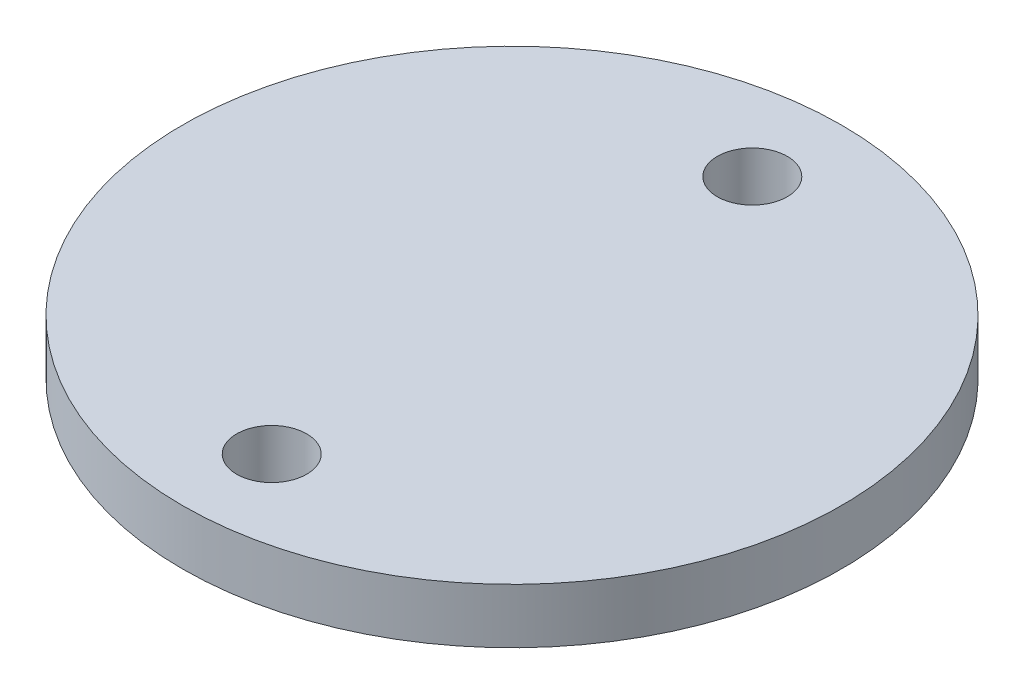
ISO-10303-21;
HEADER;
FILE_DESCRIPTION(('STEP AP214'),'2;1');
FILE_NAME('part.step','',(''),(''),'','','');
FILE_SCHEMA(('AUTOMOTIVE_DESIGN { 1 0 10303 214 1 1 1 1 }'));
ENDSEC;
DATA;
#1=APPLICATION_CONTEXT('core data for automotive mechanical design processes');
#2=APPLICATION_PROTOCOL_DEFINITION('international standard','automotive_design',2000,#1);
#3=PRODUCT_CONTEXT('',#1,'mechanical');
#4=PRODUCT('Part','Part','',(#3));
#5=PRODUCT_RELATED_PRODUCT_CATEGORY('part','',(#4));
#6=PRODUCT_DEFINITION_FORMATION('','',#4);
#7=PRODUCT_DEFINITION_CONTEXT('part definition',#1,'design');
#8=PRODUCT_DEFINITION('design','',#6,#7);
#9=PRODUCT_DEFINITION_SHAPE('','',#8);
#10=(LENGTH_UNIT() NAMED_UNIT(*) SI_UNIT(.MILLI.,.METRE.));
#11=(NAMED_UNIT(*) PLANE_ANGLE_UNIT() SI_UNIT($,.RADIAN.));
#12=(NAMED_UNIT(*) SI_UNIT($,.STERADIAN.) SOLID_ANGLE_UNIT());
#13=UNCERTAINTY_MEASURE_WITH_UNIT(LENGTH_MEASURE(1.E-05),#10,'distance_accuracy_value','');
#14=(GEOMETRIC_REPRESENTATION_CONTEXT(3) GLOBAL_UNCERTAINTY_ASSIGNED_CONTEXT((#13)) GLOBAL_UNIT_ASSIGNED_CONTEXT((#10,
#11,#12)) REPRESENTATION_CONTEXT('',''));
#15=CARTESIAN_POINT('',(0.,0.,0.));
#16=DIRECTION('',(0.,0.,1.));
#17=DIRECTION('',(1.,0.,0.));
#18=AXIS2_PLACEMENT_3D('',#15,#16,#17);
#19=CARTESIAN_POINT('',(0.,5.08,0.));
#20=DIRECTION('',(0.,-1.,0.));
#21=DIRECTION('',(0.,0.,-1.));
#22=AXIS2_PLACEMENT_3D('',#19,#20,#21);
#23=CYLINDRICAL_SURFACE('',#22,30.48);
#24=CARTESIAN_POINT('',(0.,5.08,0.));
#25=DIRECTION('',(0.,1.,0.));
#26=DIRECTION('',(0.,0.,1.));
#27=AXIS2_PLACEMENT_3D('',#24,#25,#26);
#28=CIRCLE('',#27,30.48);
#29=CARTESIAN_POINT('',(0.,5.08,30.48));
#30=VERTEX_POINT('',#29);
#31=EDGE_CURVE('E10',#30,#30,#28,.T.);
#32=ORIENTED_EDGE('',*,*,#31,.F.);
#33=EDGE_LOOP('',(#32));
#34=FACE_BOUND('',#33,.T.);
#35=CARTESIAN_POINT('',(0.,0.,0.));
#36=DIRECTION('',(0.,1.,0.));
#37=DIRECTION('',(0.,0.,1.));
#38=AXIS2_PLACEMENT_3D('',#35,#36,#37);
#39=CIRCLE('',#38,30.48);
#40=CARTESIAN_POINT('',(0.,0.,30.48));
#41=VERTEX_POINT('',#40);
#42=EDGE_CURVE('E44',#41,#41,#39,.T.);
#43=ORIENTED_EDGE('',*,*,#42,.T.);
#44=EDGE_LOOP('',(#43));
#45=FACE_BOUND('',#44,.T.);
#46=ADVANCED_FACE('F41',(#34,#45),#23,.T.);
#47=CARTESIAN_POINT('',(0.,5.08,0.));
#48=DIRECTION('',(0.,1.,0.));
#49=DIRECTION('',(0.,0.,1.));
#50=AXIS2_PLACEMENT_3D('',#47,#48,#49);
#51=PLANE('',#50);
#52=CARTESIAN_POINT('',(0.,5.08,-22.225));
#53=DIRECTION('',(0.,1.,0.));
#54=DIRECTION('',(0.,0.,1.));
#55=AXIS2_PLACEMENT_3D('',#52,#53,#54);
#56=CIRCLE('',#55,3.2385);
#57=CARTESIAN_POINT('',(0.,5.08,-18.9865));
#58=VERTEX_POINT('',#57);
#59=EDGE_CURVE('E59',#58,#58,#56,.T.);
#60=ORIENTED_EDGE('',*,*,#59,.F.);
#61=EDGE_LOOP('',(#60));
#62=FACE_BOUND('',#61,.T.);
#63=CARTESIAN_POINT('',(0.,5.08,22.225));
#64=DIRECTION('',(0.,1.,0.));
#65=DIRECTION('',(0.,0.,1.));
#66=AXIS2_PLACEMENT_3D('',#63,#64,#65);
#67=CIRCLE('',#66,3.2385);
#68=CARTESIAN_POINT('',(0.,5.08,25.4635));
#69=VERTEX_POINT('',#68);
#70=EDGE_CURVE('E56',#69,#69,#67,.T.);
#71=ORIENTED_EDGE('',*,*,#70,.F.);
#72=EDGE_LOOP('',(#71));
#73=FACE_BOUND('',#72,.T.);
#74=ORIENTED_EDGE('',*,*,#31,.T.);
#75=EDGE_LOOP('',(#74));
#76=FACE_BOUND('',#75,.T.);
#77=ADVANCED_FACE('F75',(#62,#73,#76),#51,.T.);
#78=CARTESIAN_POINT('',(0.,0.,0.));
#79=DIRECTION('',(0.,1.,0.));
#80=DIRECTION('',(0.,0.,1.));
#81=AXIS2_PLACEMENT_3D('',#78,#79,#80);
#82=PLANE('',#81);
#83=CARTESIAN_POINT('',(0.,0.,-22.225));
#84=DIRECTION('',(0.,1.,0.));
#85=DIRECTION('',(0.,0.,1.));
#86=AXIS2_PLACEMENT_3D('',#83,#84,#85);
#87=CIRCLE('',#86,3.2385);
#88=CARTESIAN_POINT('',(0.,0.,-18.9865));
#89=VERTEX_POINT('',#88);
#90=EDGE_CURVE('E51',#89,#89,#87,.T.);
#91=ORIENTED_EDGE('',*,*,#90,.T.);
#92=EDGE_LOOP('',(#91));
#93=FACE_BOUND('',#92,.T.);
#94=CARTESIAN_POINT('',(0.,0.,22.225));
#95=DIRECTION('',(0.,1.,0.));
#96=DIRECTION('',(0.,0.,1.));
#97=AXIS2_PLACEMENT_3D('',#94,#95,#96);
#98=CIRCLE('',#97,3.2385);
#99=CARTESIAN_POINT('',(0.,0.,25.4635));
#100=VERTEX_POINT('',#99);
#101=EDGE_CURVE('E53',#100,#100,#98,.T.);
#102=ORIENTED_EDGE('',*,*,#101,.T.);
#103=EDGE_LOOP('',(#102));
#104=FACE_BOUND('',#103,.T.);
#105=ORIENTED_EDGE('',*,*,#42,.F.);
#106=EDGE_LOOP('',(#105));
#107=FACE_BOUND('',#106,.T.);
#108=ADVANCED_FACE('F65',(#93,#104,#107),#82,.F.);
#109=CARTESIAN_POINT('',(0.,0.,22.225));
#110=DIRECTION('',(0.,1.,0.));
#111=DIRECTION('',(0.,0.,1.));
#112=AXIS2_PLACEMENT_3D('',#109,#110,#111);
#113=CYLINDRICAL_SURFACE('',#112,3.2385);
#114=ORIENTED_EDGE('',*,*,#101,.F.);
#115=EDGE_LOOP('',(#114));
#116=FACE_BOUND('',#115,.T.);
#117=ORIENTED_EDGE('',*,*,#70,.T.);
#118=EDGE_LOOP('',(#117));
#119=FACE_BOUND('',#118,.T.);
#120=ADVANCED_FACE('F71',(#116,#119),#113,.F.);
#121=CARTESIAN_POINT('',(0.,0.,-22.225));
#122=DIRECTION('',(0.,1.,0.));
#123=DIRECTION('',(0.,0.,1.));
#124=AXIS2_PLACEMENT_3D('',#121,#122,#123);
#125=CYLINDRICAL_SURFACE('',#124,3.2385);
#126=ORIENTED_EDGE('',*,*,#90,.F.);
#127=EDGE_LOOP('',(#126));
#128=FACE_BOUND('',#127,.T.);
#129=ORIENTED_EDGE('',*,*,#59,.T.);
#130=EDGE_LOOP('',(#129));
#131=FACE_BOUND('',#130,.T.);
#132=ADVANCED_FACE('F68',(#128,#131),#125,.F.);
#133=CLOSED_SHELL('',(#46,#77,#108,#120,#132));
#134=MANIFOLD_SOLID_BREP('B2',#133);
#135=ADVANCED_BREP_SHAPE_REPRESENTATION('',(#18,#134),#14);
#136=SHAPE_DEFINITION_REPRESENTATION(#9,#135);
ENDSEC;
END-ISO-10303-21;
